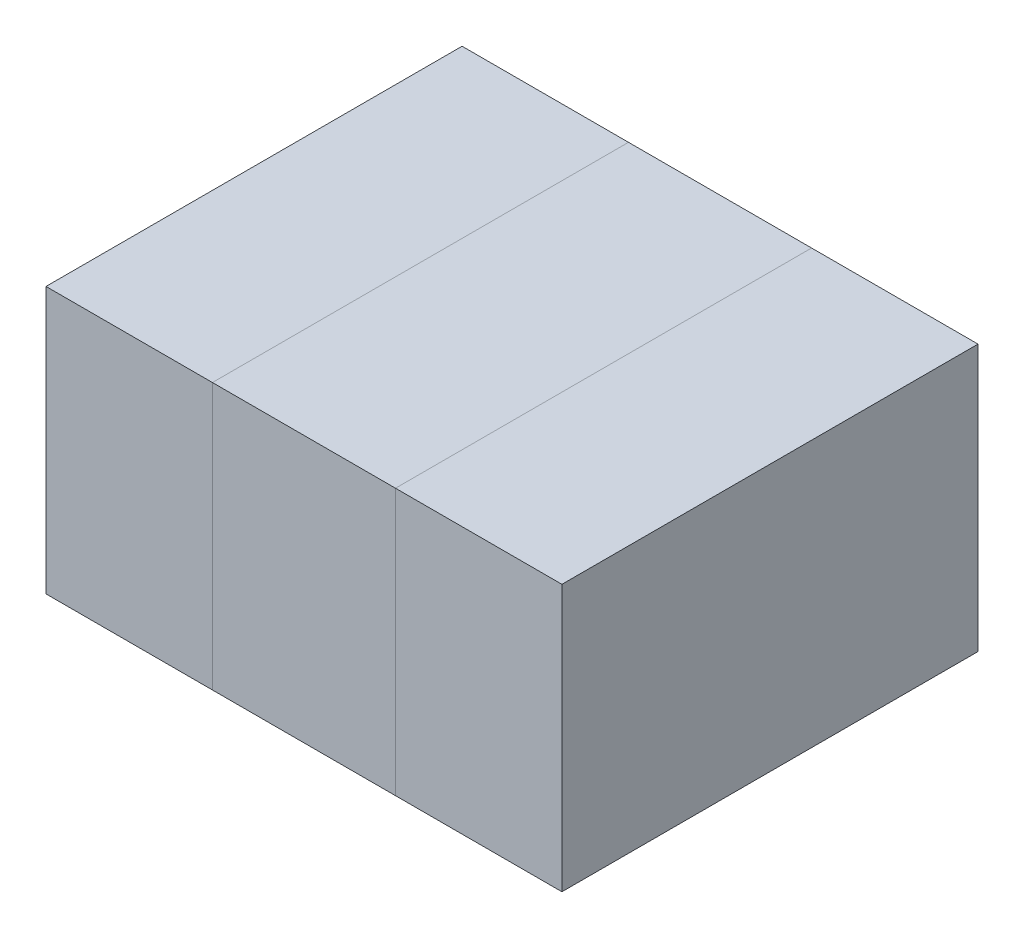
ISO-10303-21;
HEADER;
FILE_DESCRIPTION(('STEP AP214'),'2;1');
FILE_NAME('part.step','',(''),(''),'','','');
FILE_SCHEMA(('AUTOMOTIVE_DESIGN { 1 0 10303 214 1 1 1 1 }'));
ENDSEC;
DATA;
#1=APPLICATION_CONTEXT('core data for automotive mechanical design processes');
#2=APPLICATION_PROTOCOL_DEFINITION('international standard','automotive_design',2000,#1);
#3=PRODUCT_CONTEXT('',#1,'mechanical');
#4=PRODUCT('Part','Part','',(#3));
#5=PRODUCT_RELATED_PRODUCT_CATEGORY('part','',(#4));
#6=PRODUCT_DEFINITION_FORMATION('','',#4);
#7=PRODUCT_DEFINITION_CONTEXT('part definition',#1,'design');
#8=PRODUCT_DEFINITION('design','',#6,#7);
#9=PRODUCT_DEFINITION_SHAPE('','',#8);
#10=(LENGTH_UNIT() NAMED_UNIT(*) SI_UNIT(.MILLI.,.METRE.));
#11=(NAMED_UNIT(*) PLANE_ANGLE_UNIT() SI_UNIT($,.RADIAN.));
#12=(NAMED_UNIT(*) SI_UNIT($,.STERADIAN.) SOLID_ANGLE_UNIT());
#13=UNCERTAINTY_MEASURE_WITH_UNIT(LENGTH_MEASURE(1.E-05),#10,'distance_accuracy_value','');
#14=(GEOMETRIC_REPRESENTATION_CONTEXT(3) GLOBAL_UNCERTAINTY_ASSIGNED_CONTEXT((#13)) GLOBAL_UNIT_ASSIGNED_CONTEXT((#10,
#11,#12)) REPRESENTATION_CONTEXT('',''));
#15=CARTESIAN_POINT('',(0.,0.,0.));
#16=DIRECTION('',(0.,0.,1.));
#17=DIRECTION('',(1.,0.,0.));
#18=AXIS2_PLACEMENT_3D('',#15,#16,#17);
#19=CARTESIAN_POINT('',(0.275,0.8,-0.625));
#20=DIRECTION('',(1.,0.,0.));
#21=DIRECTION('',(0.,0.,-1.));
#22=AXIS2_PLACEMENT_3D('',#19,#20,#21);
#23=PLANE('',#22);
#24=DIRECTION('',(0.,0.,1.));
#25=VECTOR('',#24,1.);
#26=CARTESIAN_POINT('',(0.275,0.,-0.625));
#27=LINE('',#26,#25);
#28=CARTESIAN_POINT('',(0.275,0.,-0.625));
#29=VERTEX_POINT('',#28);
#30=CARTESIAN_POINT('',(0.275,0.,0.625));
#31=VERTEX_POINT('',#30);
#32=EDGE_CURVE('E107',#29,#31,#27,.T.);
#33=ORIENTED_EDGE('',*,*,#32,.T.);
#34=DIRECTION('',(0.,-1.,0.));
#35=VECTOR('',#34,1.);
#36=CARTESIAN_POINT('',(0.275,0.8,0.625));
#37=LINE('',#36,#35);
#38=CARTESIAN_POINT('',(0.275,0.8,0.625));
#39=VERTEX_POINT('',#38);
#40=EDGE_CURVE('E12',#39,#31,#37,.T.);
#41=ORIENTED_EDGE('',*,*,#40,.F.);
#42=DIRECTION('',(0.,0.,1.));
#43=VECTOR('',#42,1.);
#44=CARTESIAN_POINT('',(0.275,0.8,-0.625));
#45=LINE('',#44,#43);
#46=CARTESIAN_POINT('',(0.275,0.8,-0.625));
#47=VERTEX_POINT('',#46);
#48=EDGE_CURVE('E95',#47,#39,#45,.T.);
#49=ORIENTED_EDGE('',*,*,#48,.F.);
#50=DIRECTION('',(0.,-1.,0.));
#51=VECTOR('',#50,1.);
#52=CARTESIAN_POINT('',(0.275,0.8,-0.625));
#53=LINE('',#52,#51);
#54=EDGE_CURVE('E103',#47,#29,#53,.T.);
#55=ORIENTED_EDGE('',*,*,#54,.T.);
#56=EDGE_LOOP('',(#33,#41,#49,#55));
#57=FACE_BOUND('',#56,.T.);
#58=ADVANCED_FACE('F44',(#57),#23,.F.);
#59=CARTESIAN_POINT('',(0.275,0.8,0.625));
#60=DIRECTION('',(0.,0.,-1.));
#61=DIRECTION('',(-1.,0.,0.));
#62=AXIS2_PLACEMENT_3D('',#59,#60,#61);
#63=PLANE('',#62);
#64=DIRECTION('',(1.,0.,0.));
#65=VECTOR('',#64,1.);
#66=CARTESIAN_POINT('',(0.275,0.,0.625));
#67=LINE('',#66,#65);
#68=CARTESIAN_POINT('',(0.775,0.,0.625));
#69=VERTEX_POINT('',#68);
#70=EDGE_CURVE('E99',#31,#69,#67,.T.);
#71=ORIENTED_EDGE('',*,*,#70,.T.);
#72=DIRECTION('',(0.,-1.,0.));
#73=VECTOR('',#72,1.);
#74=CARTESIAN_POINT('',(0.775,0.8,0.625));
#75=LINE('',#74,#73);
#76=CARTESIAN_POINT('',(0.775,0.8,0.625));
#77=VERTEX_POINT('',#76);
#78=EDGE_CURVE('E52',#77,#69,#75,.T.);
#79=ORIENTED_EDGE('',*,*,#78,.F.);
#80=DIRECTION('',(1.,0.,0.));
#81=VECTOR('',#80,1.);
#82=CARTESIAN_POINT('',(0.275,0.8,0.625));
#83=LINE('',#82,#81);
#84=EDGE_CURVE('E90',#39,#77,#83,.T.);
#85=ORIENTED_EDGE('',*,*,#84,.F.);
#86=ORIENTED_EDGE('',*,*,#40,.T.);
#87=EDGE_LOOP('',(#71,#79,#85,#86));
#88=FACE_BOUND('',#87,.T.);
#89=ADVANCED_FACE('F98',(#88),#63,.F.);
#90=CARTESIAN_POINT('',(0.775,0.8,-0.625));
#91=DIRECTION('',(-1.,0.,0.));
#92=DIRECTION('',(0.,0.,1.));
#93=AXIS2_PLACEMENT_3D('',#90,#91,#92);
#94=PLANE('',#93);
#95=DIRECTION('',(0.,0.,-1.));
#96=VECTOR('',#95,1.);
#97=CARTESIAN_POINT('',(0.775,0.,-0.625));
#98=LINE('',#97,#96);
#99=CARTESIAN_POINT('',(0.775,0.,-0.625));
#100=VERTEX_POINT('',#99);
#101=EDGE_CURVE('E77',#69,#100,#98,.T.);
#102=ORIENTED_EDGE('',*,*,#101,.T.);
#103=DIRECTION('',(0.,-1.,0.));
#104=VECTOR('',#103,1.);
#105=CARTESIAN_POINT('',(0.775,0.8,-0.625));
#106=LINE('',#105,#104);
#107=CARTESIAN_POINT('',(0.775,0.8,-0.625));
#108=VERTEX_POINT('',#107);
#109=EDGE_CURVE('E100',#108,#100,#106,.T.);
#110=ORIENTED_EDGE('',*,*,#109,.F.);
#111=DIRECTION('',(0.,0.,-1.));
#112=VECTOR('',#111,1.);
#113=CARTESIAN_POINT('',(0.775,0.8,-0.625));
#114=LINE('',#113,#112);
#115=EDGE_CURVE('E93',#77,#108,#114,.T.);
#116=ORIENTED_EDGE('',*,*,#115,.F.);
#117=ORIENTED_EDGE('',*,*,#78,.T.);
#118=EDGE_LOOP('',(#102,#110,#116,#117));
#119=FACE_BOUND('',#118,.T.);
#120=ADVANCED_FACE('F101',(#119),#94,.F.);
#121=CARTESIAN_POINT('',(0.275,0.8,-0.625));
#122=DIRECTION('',(0.,0.,1.));
#123=DIRECTION('',(1.,0.,0.));
#124=AXIS2_PLACEMENT_3D('',#121,#122,#123);
#125=PLANE('',#124);
#126=DIRECTION('',(-1.,0.,0.));
#127=VECTOR('',#126,1.);
#128=CARTESIAN_POINT('',(0.275,0.,-0.625));
#129=LINE('',#128,#127);
#130=EDGE_CURVE('E83',#100,#29,#129,.T.);
#131=ORIENTED_EDGE('',*,*,#130,.T.);
#132=ORIENTED_EDGE('',*,*,#54,.F.);
#133=DIRECTION('',(-1.,0.,0.));
#134=VECTOR('',#133,1.);
#135=CARTESIAN_POINT('',(0.275,0.8,-0.625));
#136=LINE('',#135,#134);
#137=EDGE_CURVE('E60',#108,#47,#136,.T.);
#138=ORIENTED_EDGE('',*,*,#137,.F.);
#139=ORIENTED_EDGE('',*,*,#109,.T.);
#140=EDGE_LOOP('',(#131,#132,#138,#139));
#141=FACE_BOUND('',#140,.T.);
#142=ADVANCED_FACE('F114',(#141),#125,.F.);
#143=CARTESIAN_POINT('',(0.,0.8,0.));
#144=DIRECTION('',(0.,1.,0.));
#145=DIRECTION('',(0.,0.,1.));
#146=AXIS2_PLACEMENT_3D('',#143,#144,#145);
#147=PLANE('',#146);
#148=ORIENTED_EDGE('',*,*,#48,.T.);
#149=ORIENTED_EDGE('',*,*,#84,.T.);
#150=ORIENTED_EDGE('',*,*,#115,.T.);
#151=ORIENTED_EDGE('',*,*,#137,.T.);
#152=EDGE_LOOP('',(#148,#149,#150,#151));
#153=FACE_BOUND('',#152,.T.);
#154=ADVANCED_FACE('F91',(#153),#147,.T.);
#155=CARTESIAN_POINT('',(0.,0.,0.));
#156=DIRECTION('',(0.,1.,0.));
#157=DIRECTION('',(0.,0.,1.));
#158=AXIS2_PLACEMENT_3D('',#155,#156,#157);
#159=PLANE('',#158);
#160=ORIENTED_EDGE('',*,*,#32,.F.);
#161=ORIENTED_EDGE('',*,*,#130,.F.);
#162=ORIENTED_EDGE('',*,*,#101,.F.);
#163=ORIENTED_EDGE('',*,*,#70,.F.);
#164=EDGE_LOOP('',(#160,#161,#162,#163));
#165=FACE_BOUND('',#164,.T.);
#166=ADVANCED_FACE('F117',(#165),#159,.F.);
#167=CLOSED_SHELL('',(#58,#89,#120,#142,#154,#166));
#168=MANIFOLD_SOLID_BREP('B2',#167);
#169=CARTESIAN_POINT('',(-0.275,0.8,-0.625));
#170=DIRECTION('',(-1.,0.,0.));
#171=DIRECTION('',(0.,0.,1.));
#172=AXIS2_PLACEMENT_3D('',#169,#170,#171);
#173=PLANE('',#172);
#174=DIRECTION('',(0.,0.,-1.));
#175=VECTOR('',#174,1.);
#176=CARTESIAN_POINT('',(-0.275,0.,-0.625));
#177=LINE('',#176,#175);
#178=CARTESIAN_POINT('',(-0.275,0.,0.625));
#179=VERTEX_POINT('',#178);
#180=CARTESIAN_POINT('',(-0.275,0.,-0.625));
#181=VERTEX_POINT('',#180);
#182=EDGE_CURVE('E240',#179,#181,#177,.T.);
#183=ORIENTED_EDGE('',*,*,#182,.T.);
#184=DIRECTION('',(0.,-1.,0.));
#185=VECTOR('',#184,1.);
#186=CARTESIAN_POINT('',(-0.275,0.8,-0.625));
#187=LINE('',#186,#185);
#188=CARTESIAN_POINT('',(-0.275,0.8,-0.625));
#189=VERTEX_POINT('',#188);
#190=EDGE_CURVE('E42',#189,#181,#187,.T.);
#191=ORIENTED_EDGE('',*,*,#190,.F.);
#192=DIRECTION('',(0.,0.,-1.));
#193=VECTOR('',#192,1.);
#194=CARTESIAN_POINT('',(-0.275,0.8,-0.625));
#195=LINE('',#194,#193);
#196=CARTESIAN_POINT('',(-0.275,0.8,0.625));
#197=VERTEX_POINT('',#196);
#198=EDGE_CURVE('E228',#197,#189,#195,.T.);
#199=ORIENTED_EDGE('',*,*,#198,.F.);
#200=DIRECTION('',(0.,-1.,0.));
#201=VECTOR('',#200,1.);
#202=CARTESIAN_POINT('',(-0.275,0.8,0.625));
#203=LINE('',#202,#201);
#204=EDGE_CURVE('E236',#197,#179,#203,.T.);
#205=ORIENTED_EDGE('',*,*,#204,.T.);
#206=EDGE_LOOP('',(#183,#191,#199,#205));
#207=FACE_BOUND('',#206,.T.);
#208=ADVANCED_FACE('F177',(#207),#173,.F.);
#209=CARTESIAN_POINT('',(-0.275,0.8,-0.625));
#210=DIRECTION('',(0.,0.,1.));
#211=DIRECTION('',(1.,0.,0.));
#212=AXIS2_PLACEMENT_3D('',#209,#210,#211);
#213=PLANE('',#212);
#214=DIRECTION('',(-1.,0.,0.));
#215=VECTOR('',#214,1.);
#216=CARTESIAN_POINT('',(-0.275,0.,-0.625));
#217=LINE('',#216,#215);
#218=CARTESIAN_POINT('',(-0.775,0.,-0.625));
#219=VERTEX_POINT('',#218);
#220=EDGE_CURVE('E232',#181,#219,#217,.T.);
#221=ORIENTED_EDGE('',*,*,#220,.T.);
#222=DIRECTION('',(0.,-1.,0.));
#223=VECTOR('',#222,1.);
#224=CARTESIAN_POINT('',(-0.775,0.8,-0.625));
#225=LINE('',#224,#223);
#226=CARTESIAN_POINT('',(-0.775,0.8,-0.625));
#227=VERTEX_POINT('',#226);
#228=EDGE_CURVE('E185',#227,#219,#225,.T.);
#229=ORIENTED_EDGE('',*,*,#228,.F.);
#230=DIRECTION('',(-1.,0.,0.));
#231=VECTOR('',#230,1.);
#232=CARTESIAN_POINT('',(-0.275,0.8,-0.625));
#233=LINE('',#232,#231);
#234=EDGE_CURVE('E223',#189,#227,#233,.T.);
#235=ORIENTED_EDGE('',*,*,#234,.F.);
#236=ORIENTED_EDGE('',*,*,#190,.T.);
#237=EDGE_LOOP('',(#221,#229,#235,#236));
#238=FACE_BOUND('',#237,.T.);
#239=ADVANCED_FACE('F231',(#238),#213,.F.);
#240=CARTESIAN_POINT('',(-0.775,0.8,-0.625));
#241=DIRECTION('',(1.,0.,0.));
#242=DIRECTION('',(0.,0.,-1.));
#243=AXIS2_PLACEMENT_3D('',#240,#241,#242);
#244=PLANE('',#243);
#245=DIRECTION('',(0.,0.,1.));
#246=VECTOR('',#245,1.);
#247=CARTESIAN_POINT('',(-0.775,0.,-0.625));
#248=LINE('',#247,#246);
#249=CARTESIAN_POINT('',(-0.775,0.,0.625));
#250=VERTEX_POINT('',#249);
#251=EDGE_CURVE('E210',#219,#250,#248,.T.);
#252=ORIENTED_EDGE('',*,*,#251,.T.);
#253=DIRECTION('',(0.,-1.,0.));
#254=VECTOR('',#253,1.);
#255=CARTESIAN_POINT('',(-0.775,0.8,0.625));
#256=LINE('',#255,#254);
#257=CARTESIAN_POINT('',(-0.775,0.8,0.625));
#258=VERTEX_POINT('',#257);
#259=EDGE_CURVE('E233',#258,#250,#256,.T.);
#260=ORIENTED_EDGE('',*,*,#259,.F.);
#261=DIRECTION('',(0.,0.,1.));
#262=VECTOR('',#261,1.);
#263=CARTESIAN_POINT('',(-0.775,0.8,-0.625));
#264=LINE('',#263,#262);
#265=EDGE_CURVE('E226',#227,#258,#264,.T.);
#266=ORIENTED_EDGE('',*,*,#265,.F.);
#267=ORIENTED_EDGE('',*,*,#228,.T.);
#268=EDGE_LOOP('',(#252,#260,#266,#267));
#269=FACE_BOUND('',#268,.T.);
#270=ADVANCED_FACE('F234',(#269),#244,.F.);
#271=CARTESIAN_POINT('',(-0.275,0.8,0.625));
#272=DIRECTION('',(0.,0.,-1.));
#273=DIRECTION('',(-1.,0.,0.));
#274=AXIS2_PLACEMENT_3D('',#271,#272,#273);
#275=PLANE('',#274);
#276=DIRECTION('',(1.,0.,0.));
#277=VECTOR('',#276,1.);
#278=CARTESIAN_POINT('',(-0.275,0.,0.625));
#279=LINE('',#278,#277);
#280=EDGE_CURVE('E216',#250,#179,#279,.T.);
#281=ORIENTED_EDGE('',*,*,#280,.T.);
#282=ORIENTED_EDGE('',*,*,#204,.F.);
#283=DIRECTION('',(1.,0.,0.));
#284=VECTOR('',#283,1.);
#285=CARTESIAN_POINT('',(-0.275,0.8,0.625));
#286=LINE('',#285,#284);
#287=EDGE_CURVE('E193',#258,#197,#286,.T.);
#288=ORIENTED_EDGE('',*,*,#287,.F.);
#289=ORIENTED_EDGE('',*,*,#259,.T.);
#290=EDGE_LOOP('',(#281,#282,#288,#289));
#291=FACE_BOUND('',#290,.T.);
#292=ADVANCED_FACE('F247',(#291),#275,.F.);
#293=CARTESIAN_POINT('',(0.,0.8,0.));
#294=DIRECTION('',(0.,-1.,0.));
#295=DIRECTION('',(0.,0.,-1.));
#296=AXIS2_PLACEMENT_3D('',#293,#294,#295);
#297=PLANE('',#296);
#298=ORIENTED_EDGE('',*,*,#198,.T.);
#299=ORIENTED_EDGE('',*,*,#234,.T.);
#300=ORIENTED_EDGE('',*,*,#265,.T.);
#301=ORIENTED_EDGE('',*,*,#287,.T.);
#302=EDGE_LOOP('',(#298,#299,#300,#301));
#303=FACE_BOUND('',#302,.T.);
#304=ADVANCED_FACE('F224',(#303),#297,.F.);
#305=CARTESIAN_POINT('',(0.,0.,0.));
#306=DIRECTION('',(0.,-1.,0.));
#307=DIRECTION('',(0.,0.,-1.));
#308=AXIS2_PLACEMENT_3D('',#305,#306,#307);
#309=PLANE('',#308);
#310=ORIENTED_EDGE('',*,*,#182,.F.);
#311=ORIENTED_EDGE('',*,*,#280,.F.);
#312=ORIENTED_EDGE('',*,*,#251,.F.);
#313=ORIENTED_EDGE('',*,*,#220,.F.);
#314=EDGE_LOOP('',(#310,#311,#312,#313));
#315=FACE_BOUND('',#314,.T.);
#316=ADVANCED_FACE('F250',(#315),#309,.T.);
#317=CLOSED_SHELL('',(#208,#239,#270,#292,#304,#316));
#318=MANIFOLD_SOLID_BREP('B6',#317);
#319=CARTESIAN_POINT('',(0.275,0.8,0.625));
#320=DIRECTION('',(-1.,0.,0.));
#321=DIRECTION('',(0.,0.,1.));
#322=AXIS2_PLACEMENT_3D('',#319,#320,#321);
#323=PLANE('',#322);
#324=DIRECTION('',(0.,0.,-1.));
#325=VECTOR('',#324,1.);
#326=CARTESIAN_POINT('',(0.275,0.,0.625));
#327=LINE('',#326,#325);
#328=CARTESIAN_POINT('',(0.275,0.,0.625));
#329=VERTEX_POINT('',#328);
#330=CARTESIAN_POINT('',(0.275,0.,-0.625));
#331=VERTEX_POINT('',#330);
#332=EDGE_CURVE('E364',#329,#331,#327,.T.);
#333=ORIENTED_EDGE('',*,*,#332,.T.);
#334=DIRECTION('',(0.,-1.,0.));
#335=VECTOR('',#334,1.);
#336=CARTESIAN_POINT('',(0.275,0.8,-0.625));
#337=LINE('',#336,#335);
#338=CARTESIAN_POINT('',(0.275,0.8,-0.625));
#339=VERTEX_POINT('',#338);
#340=EDGE_CURVE('E175',#339,#331,#337,.T.);
#341=ORIENTED_EDGE('',*,*,#340,.F.);
#342=DIRECTION('',(0.,0.,-1.));
#343=VECTOR('',#342,1.);
#344=CARTESIAN_POINT('',(0.275,0.8,0.625));
#345=LINE('',#344,#343);
#346=CARTESIAN_POINT('',(0.275,0.8,0.625));
#347=VERTEX_POINT('',#346);
#348=EDGE_CURVE('E352',#347,#339,#345,.T.);
#349=ORIENTED_EDGE('',*,*,#348,.F.);
#350=DIRECTION('',(0.,-1.,0.));
#351=VECTOR('',#350,1.);
#352=CARTESIAN_POINT('',(0.275,0.8,0.625));
#353=LINE('',#352,#351);
#354=EDGE_CURVE('E360',#347,#329,#353,.T.);
#355=ORIENTED_EDGE('',*,*,#354,.T.);
#356=EDGE_LOOP('',(#333,#341,#349,#355));
#357=FACE_BOUND('',#356,.T.);
#358=ADVANCED_FACE('F301',(#357),#323,.F.);
#359=CARTESIAN_POINT('',(-0.275,0.8,-0.625));
#360=DIRECTION('',(0.,0.,1.));
#361=DIRECTION('',(1.,0.,0.));
#362=AXIS2_PLACEMENT_3D('',#359,#360,#361);
#363=PLANE('',#362);
#364=DIRECTION('',(-1.,0.,0.));
#365=VECTOR('',#364,1.);
#366=CARTESIAN_POINT('',(-0.275,0.,-0.625));
#367=LINE('',#366,#365);
#368=CARTESIAN_POINT('',(-0.275,0.,-0.625));
#369=VERTEX_POINT('',#368);
#370=EDGE_CURVE('E356',#331,#369,#367,.T.);
#371=ORIENTED_EDGE('',*,*,#370,.T.);
#372=DIRECTION('',(0.,-1.,0.));
#373=VECTOR('',#372,1.);
#374=CARTESIAN_POINT('',(-0.275,0.8,-0.625));
#375=LINE('',#374,#373);
#376=CARTESIAN_POINT('',(-0.275,0.8,-0.625));
#377=VERTEX_POINT('',#376);
#378=EDGE_CURVE('E309',#377,#369,#375,.T.);
#379=ORIENTED_EDGE('',*,*,#378,.F.);
#380=DIRECTION('',(-1.,0.,0.));
#381=VECTOR('',#380,1.);
#382=CARTESIAN_POINT('',(-0.275,0.8,-0.625));
#383=LINE('',#382,#381);
#384=EDGE_CURVE('E347',#339,#377,#383,.T.);
#385=ORIENTED_EDGE('',*,*,#384,.F.);
#386=ORIENTED_EDGE('',*,*,#340,.T.);
#387=EDGE_LOOP('',(#371,#379,#385,#386));
#388=FACE_BOUND('',#387,.T.);
#389=ADVANCED_FACE('F355',(#388),#363,.F.);
#390=CARTESIAN_POINT('',(-0.275,0.8,0.625));
#391=DIRECTION('',(1.,0.,0.));
#392=DIRECTION('',(0.,0.,-1.));
#393=AXIS2_PLACEMENT_3D('',#390,#391,#392);
#394=PLANE('',#393);
#395=DIRECTION('',(0.,0.,1.));
#396=VECTOR('',#395,1.);
#397=CARTESIAN_POINT('',(-0.275,0.,0.625));
#398=LINE('',#397,#396);
#399=CARTESIAN_POINT('',(-0.275,0.,0.625));
#400=VERTEX_POINT('',#399);
#401=EDGE_CURVE('E334',#369,#400,#398,.T.);
#402=ORIENTED_EDGE('',*,*,#401,.T.);
#403=DIRECTION('',(0.,-1.,0.));
#404=VECTOR('',#403,1.);
#405=CARTESIAN_POINT('',(-0.275,0.8,0.625));
#406=LINE('',#405,#404);
#407=CARTESIAN_POINT('',(-0.275,0.8,0.625));
#408=VERTEX_POINT('',#407);
#409=EDGE_CURVE('E357',#408,#400,#406,.T.);
#410=ORIENTED_EDGE('',*,*,#409,.F.);
#411=DIRECTION('',(0.,0.,1.));
#412=VECTOR('',#411,1.);
#413=CARTESIAN_POINT('',(-0.275,0.8,0.625));
#414=LINE('',#413,#412);
#415=EDGE_CURVE('E350',#377,#408,#414,.T.);
#416=ORIENTED_EDGE('',*,*,#415,.F.);
#417=ORIENTED_EDGE('',*,*,#378,.T.);
#418=EDGE_LOOP('',(#402,#410,#416,#417));
#419=FACE_BOUND('',#418,.T.);
#420=ADVANCED_FACE('F358',(#419),#394,.F.);
#421=CARTESIAN_POINT('',(-0.275,0.8,0.625));
#422=DIRECTION('',(0.,0.,-1.));
#423=DIRECTION('',(-1.,0.,0.));
#424=AXIS2_PLACEMENT_3D('',#421,#422,#423);
#425=PLANE('',#424);
#426=DIRECTION('',(1.,0.,0.));
#427=VECTOR('',#426,1.);
#428=CARTESIAN_POINT('',(-0.275,0.,0.625));
#429=LINE('',#428,#427);
#430=EDGE_CURVE('E340',#400,#329,#429,.T.);
#431=ORIENTED_EDGE('',*,*,#430,.T.);
#432=ORIENTED_EDGE('',*,*,#354,.F.);
#433=DIRECTION('',(1.,0.,0.));
#434=VECTOR('',#433,1.);
#435=CARTESIAN_POINT('',(-0.275,0.8,0.625));
#436=LINE('',#435,#434);
#437=EDGE_CURVE('E317',#408,#347,#436,.T.);
#438=ORIENTED_EDGE('',*,*,#437,.F.);
#439=ORIENTED_EDGE('',*,*,#409,.T.);
#440=EDGE_LOOP('',(#431,#432,#438,#439));
#441=FACE_BOUND('',#440,.T.);
#442=ADVANCED_FACE('F371',(#441),#425,.F.);
#443=CARTESIAN_POINT('',(0.,0.8,0.));
#444=DIRECTION('',(0.,-1.,0.));
#445=DIRECTION('',(0.,0.,-1.));
#446=AXIS2_PLACEMENT_3D('',#443,#444,#445);
#447=PLANE('',#446);
#448=ORIENTED_EDGE('',*,*,#348,.T.);
#449=ORIENTED_EDGE('',*,*,#384,.T.);
#450=ORIENTED_EDGE('',*,*,#415,.T.);
#451=ORIENTED_EDGE('',*,*,#437,.T.);
#452=EDGE_LOOP('',(#448,#449,#450,#451));
#453=FACE_BOUND('',#452,.T.);
#454=ADVANCED_FACE('F348',(#453),#447,.F.);
#455=CARTESIAN_POINT('',(0.,0.,0.));
#456=DIRECTION('',(0.,-1.,0.));
#457=DIRECTION('',(0.,0.,-1.));
#458=AXIS2_PLACEMENT_3D('',#455,#456,#457);
#459=PLANE('',#458);
#460=ORIENTED_EDGE('',*,*,#332,.F.);
#461=ORIENTED_EDGE('',*,*,#430,.F.);
#462=ORIENTED_EDGE('',*,*,#401,.F.);
#463=ORIENTED_EDGE('',*,*,#370,.F.);
#464=EDGE_LOOP('',(#460,#461,#462,#463));
#465=FACE_BOUND('',#464,.T.);
#466=ADVANCED_FACE('F374',(#465),#459,.T.);
#467=CLOSED_SHELL('',(#358,#389,#420,#442,#454,#466));
#468=MANIFOLD_SOLID_BREP('B36',#467);
#469=ADVANCED_BREP_SHAPE_REPRESENTATION('',(#18,#168,#318,#468),#14);
#470=SHAPE_DEFINITION_REPRESENTATION(#9,#469);
ENDSEC;
END-ISO-10303-21;
